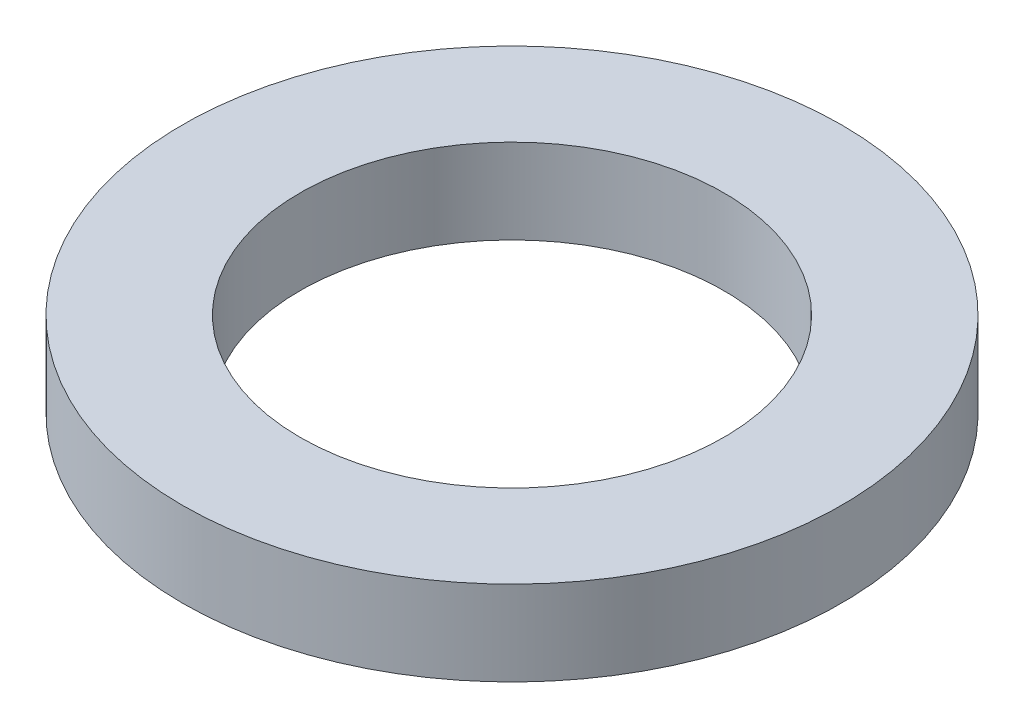
ISO-10303-21;
HEADER;
FILE_DESCRIPTION(('STEP AP214'),'2;1');
FILE_NAME('part.step','',(''),(''),'','','');
FILE_SCHEMA(('AUTOMOTIVE_DESIGN { 1 0 10303 214 1 1 1 1 }'));
ENDSEC;
DATA;
#1=APPLICATION_CONTEXT('core data for automotive mechanical design processes');
#2=APPLICATION_PROTOCOL_DEFINITION('international standard','automotive_design',2000,#1);
#3=PRODUCT_CONTEXT('',#1,'mechanical');
#4=PRODUCT('Part','Part','',(#3));
#5=PRODUCT_RELATED_PRODUCT_CATEGORY('part','',(#4));
#6=PRODUCT_DEFINITION_FORMATION('','',#4);
#7=PRODUCT_DEFINITION_CONTEXT('part definition',#1,'design');
#8=PRODUCT_DEFINITION('design','',#6,#7);
#9=PRODUCT_DEFINITION_SHAPE('','',#8);
#10=(LENGTH_UNIT() NAMED_UNIT(*) SI_UNIT(.MILLI.,.METRE.));
#11=(NAMED_UNIT(*) PLANE_ANGLE_UNIT() SI_UNIT($,.RADIAN.));
#12=(NAMED_UNIT(*) SI_UNIT($,.STERADIAN.) SOLID_ANGLE_UNIT());
#13=UNCERTAINTY_MEASURE_WITH_UNIT(LENGTH_MEASURE(1.E-05),#10,'distance_accuracy_value','');
#14=(GEOMETRIC_REPRESENTATION_CONTEXT(3) GLOBAL_UNCERTAINTY_ASSIGNED_CONTEXT((#13)) GLOBAL_UNIT_ASSIGNED_CONTEXT((#10,
#11,#12)) REPRESENTATION_CONTEXT('',''));
#15=CARTESIAN_POINT('',(0.,0.,0.));
#16=DIRECTION('',(0.,0.,1.));
#17=DIRECTION('',(1.,0.,0.));
#18=AXIS2_PLACEMENT_3D('',#15,#16,#17);
#19=CARTESIAN_POINT('',(0.,18.,0.));
#20=DIRECTION('',(0.,-1.,0.));
#21=DIRECTION('',(0.,0.,-1.));
#22=AXIS2_PLACEMENT_3D('',#19,#20,#21);
#23=CYLINDRICAL_SURFACE('',#22,70.);
#24=CARTESIAN_POINT('',(0.,18.,0.));
#25=DIRECTION('',(0.,1.,0.));
#26=DIRECTION('',(0.,0.,1.));
#27=AXIS2_PLACEMENT_3D('',#24,#25,#26);
#28=CIRCLE('',#27,70.);
#29=CARTESIAN_POINT('',(0.,18.,70.));
#30=VERTEX_POINT('',#29);
#31=EDGE_CURVE('E10',#30,#30,#28,.T.);
#32=ORIENTED_EDGE('',*,*,#31,.F.);
#33=EDGE_LOOP('',(#32));
#34=FACE_BOUND('',#33,.T.);
#35=CARTESIAN_POINT('',(0.,0.,0.));
#36=DIRECTION('',(0.,1.,0.));
#37=DIRECTION('',(0.,0.,1.));
#38=AXIS2_PLACEMENT_3D('',#35,#36,#37);
#39=CIRCLE('',#38,70.);
#40=CARTESIAN_POINT('',(0.,0.,70.));
#41=VERTEX_POINT('',#40);
#42=EDGE_CURVE('E37',#41,#41,#39,.T.);
#43=ORIENTED_EDGE('',*,*,#42,.T.);
#44=EDGE_LOOP('',(#43));
#45=FACE_BOUND('',#44,.T.);
#46=ADVANCED_FACE('F40',(#34,#45),#23,.T.);
#47=CARTESIAN_POINT('',(0.,18.,0.));
#48=DIRECTION('',(0.,1.,0.));
#49=DIRECTION('',(0.,0.,1.));
#50=AXIS2_PLACEMENT_3D('',#47,#48,#49);
#51=PLANE('',#50);
#52=CARTESIAN_POINT('',(0.,18.,0.));
#53=DIRECTION('',(0.,1.,0.));
#54=DIRECTION('',(0.,0.,1.));
#55=AXIS2_PLACEMENT_3D('',#52,#53,#54);
#56=CIRCLE('',#55,45.);
#57=CARTESIAN_POINT('',(0.,18.,45.));
#58=VERTEX_POINT('',#57);
#59=EDGE_CURVE('E50',#58,#58,#56,.T.);
#60=ORIENTED_EDGE('',*,*,#59,.F.);
#61=EDGE_LOOP('',(#60));
#62=FACE_BOUND('',#61,.T.);
#63=ORIENTED_EDGE('',*,*,#31,.T.);
#64=EDGE_LOOP('',(#63));
#65=FACE_BOUND('',#64,.T.);
#66=ADVANCED_FACE('F59',(#62,#65),#51,.T.);
#67=CARTESIAN_POINT('',(0.,0.,0.));
#68=DIRECTION('',(0.,1.,0.));
#69=DIRECTION('',(0.,0.,1.));
#70=AXIS2_PLACEMENT_3D('',#67,#68,#69);
#71=PLANE('',#70);
#72=CARTESIAN_POINT('',(0.,0.,0.));
#73=DIRECTION('',(0.,1.,0.));
#74=DIRECTION('',(0.,0.,1.));
#75=AXIS2_PLACEMENT_3D('',#72,#73,#74);
#76=CIRCLE('',#75,45.);
#77=CARTESIAN_POINT('',(0.,0.,45.));
#78=VERTEX_POINT('',#77);
#79=EDGE_CURVE('E47',#78,#78,#76,.T.);
#80=ORIENTED_EDGE('',*,*,#79,.T.);
#81=EDGE_LOOP('',(#80));
#82=FACE_BOUND('',#81,.T.);
#83=ORIENTED_EDGE('',*,*,#42,.F.);
#84=EDGE_LOOP('',(#83));
#85=FACE_BOUND('',#84,.T.);
#86=ADVANCED_FACE('F58',(#82,#85),#71,.F.);
#87=CARTESIAN_POINT('',(0.,18.,0.));
#88=DIRECTION('',(0.,-1.,0.));
#89=DIRECTION('',(0.,0.,-1.));
#90=AXIS2_PLACEMENT_3D('',#87,#88,#89);
#91=CYLINDRICAL_SURFACE('',#90,45.);
#92=ORIENTED_EDGE('',*,*,#59,.T.);
#93=EDGE_LOOP('',(#92));
#94=FACE_BOUND('',#93,.T.);
#95=ORIENTED_EDGE('',*,*,#79,.F.);
#96=EDGE_LOOP('',(#95));
#97=FACE_BOUND('',#96,.T.);
#98=ADVANCED_FACE('F54',(#94,#97),#91,.F.);
#99=CLOSED_SHELL('',(#46,#66,#86,#98));
#100=MANIFOLD_SOLID_BREP('B2',#99);
#101=ADVANCED_BREP_SHAPE_REPRESENTATION('',(#18,#100),#14);
#102=SHAPE_DEFINITION_REPRESENTATION(#9,#101);
ENDSEC;
END-ISO-10303-21;
